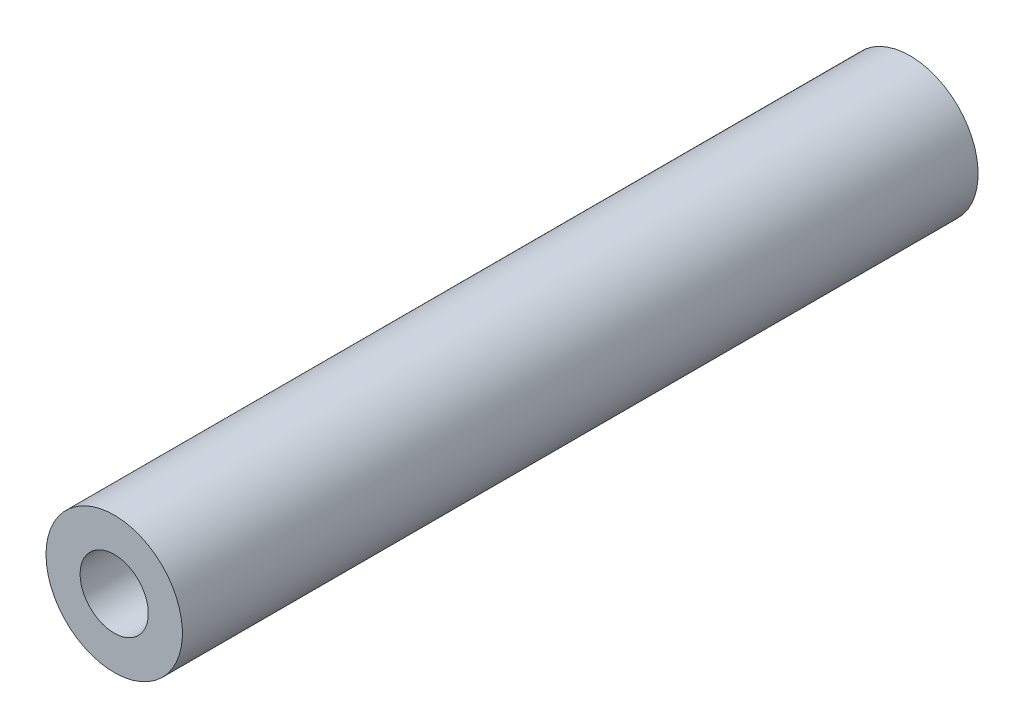
ISO-10303-21;
HEADER;
FILE_DESCRIPTION(('STEP AP214'),'2;1');
FILE_NAME('part.step','',(''),(''),'','','');
FILE_SCHEMA(('AUTOMOTIVE_DESIGN { 1 0 10303 214 1 1 1 1 }'));
ENDSEC;
DATA;
#1=APPLICATION_CONTEXT('core data for automotive mechanical design processes');
#2=APPLICATION_PROTOCOL_DEFINITION('international standard','automotive_design',2000,#1);
#3=PRODUCT_CONTEXT('',#1,'mechanical');
#4=PRODUCT('Part','Part','',(#3));
#5=PRODUCT_RELATED_PRODUCT_CATEGORY('part','',(#4));
#6=PRODUCT_DEFINITION_FORMATION('','',#4);
#7=PRODUCT_DEFINITION_CONTEXT('part definition',#1,'design');
#8=PRODUCT_DEFINITION('design','',#6,#7);
#9=PRODUCT_DEFINITION_SHAPE('','',#8);
#10=(LENGTH_UNIT() NAMED_UNIT(*) SI_UNIT(.MILLI.,.METRE.));
#11=(NAMED_UNIT(*) PLANE_ANGLE_UNIT() SI_UNIT($,.RADIAN.));
#12=(NAMED_UNIT(*) SI_UNIT($,.STERADIAN.) SOLID_ANGLE_UNIT());
#13=UNCERTAINTY_MEASURE_WITH_UNIT(LENGTH_MEASURE(1.E-05),#10,'distance_accuracy_value','');
#14=(GEOMETRIC_REPRESENTATION_CONTEXT(3) GLOBAL_UNCERTAINTY_ASSIGNED_CONTEXT((#13)) GLOBAL_UNIT_ASSIGNED_CONTEXT((#10,
#11,#12)) REPRESENTATION_CONTEXT('',''));
#15=CARTESIAN_POINT('',(0.,0.,0.));
#16=DIRECTION('',(0.,0.,1.));
#17=DIRECTION('',(1.,0.,0.));
#18=AXIS2_PLACEMENT_3D('',#15,#16,#17);
#19=CARTESIAN_POINT('',(0.,0.,0.));
#20=DIRECTION('',(0.,0.,1.));
#21=DIRECTION('',(1.,0.,0.));
#22=AXIS2_PLACEMENT_3D('',#19,#20,#21);
#23=PLANE('',#22);
#24=CARTESIAN_POINT('',(0.,0.,0.));
#25=DIRECTION('',(0.,0.,-1.));
#26=DIRECTION('',(1.,0.,0.));
#27=AXIS2_PLACEMENT_3D('',#24,#25,#26);
#28=CIRCLE('',#27,1.5);
#29=CARTESIAN_POINT('',(-1.5,0.,0.));
#30=VERTEX_POINT('',#29);
#31=EDGE_CURVE('E48',#30,#30,#28,.T.);
#32=ORIENTED_EDGE('',*,*,#31,.F.);
#33=EDGE_LOOP('',(#32));
#34=FACE_BOUND('',#33,.T.);
#35=CARTESIAN_POINT('',(0.,0.,0.));
#36=DIRECTION('',(0.,0.,1.));
#37=DIRECTION('',(1.,0.,0.));
#38=AXIS2_PLACEMENT_3D('',#35,#36,#37);
#39=CIRCLE('',#38,3.);
#40=CARTESIAN_POINT('',(-3.,0.,0.));
#41=VERTEX_POINT('',#40);
#42=EDGE_CURVE('E11',#41,#41,#39,.T.);
#43=ORIENTED_EDGE('',*,*,#42,.F.);
#44=EDGE_LOOP('',(#43));
#45=FACE_BOUND('',#44,.T.);
#46=ADVANCED_FACE('F17',(#34,#45),#23,.F.);
#47=CARTESIAN_POINT('',(0.,0.,0.));
#48=DIRECTION('',(0.,0.,1.));
#49=DIRECTION('',(1.,0.,0.));
#50=AXIS2_PLACEMENT_3D('',#47,#48,#49);
#51=CYLINDRICAL_SURFACE('',#50,3.);
#52=CARTESIAN_POINT('',(0.,0.,35.));
#53=DIRECTION('',(0.,0.,1.));
#54=DIRECTION('',(1.,0.,0.));
#55=AXIS2_PLACEMENT_3D('',#52,#53,#54);
#56=CIRCLE('',#55,3.);
#57=CARTESIAN_POINT('',(-3.,0.,35.));
#58=VERTEX_POINT('',#57);
#59=EDGE_CURVE('E55',#58,#58,#56,.T.);
#60=ORIENTED_EDGE('',*,*,#59,.F.);
#61=DIRECTION('',(0.,0.,-1.));
#62=VECTOR('',#61,1.);
#63=CARTESIAN_POINT('',(-3.,0.,0.));
#64=LINE('',#63,#62);
#65=EDGE_CURVE('E26',#58,#41,#64,.T.);
#66=ORIENTED_EDGE('',*,*,#65,.T.);
#67=ORIENTED_EDGE('',*,*,#42,.T.);
#68=ORIENTED_EDGE('',*,*,#65,.F.);
#69=EDGE_LOOP('',(#60,#66,#67,#68));
#70=FACE_BOUND('',#69,.T.);
#71=ADVANCED_FACE('F54',(#70),#51,.T.);
#72=CARTESIAN_POINT('',(0.,0.,0.));
#73=DIRECTION('',(0.,0.,1.));
#74=DIRECTION('',(1.,0.,0.));
#75=AXIS2_PLACEMENT_3D('',#72,#73,#74);
#76=CYLINDRICAL_SURFACE('',#75,1.5);
#77=CARTESIAN_POINT('',(0.,0.,35.));
#78=DIRECTION('',(0.,0.,-1.));
#79=DIRECTION('',(1.,0.,0.));
#80=AXIS2_PLACEMENT_3D('',#77,#78,#79);
#81=CIRCLE('',#80,1.5);
#82=CARTESIAN_POINT('',(-1.5,0.,35.));
#83=VERTEX_POINT('',#82);
#84=EDGE_CURVE('E20',#83,#83,#81,.T.);
#85=ORIENTED_EDGE('',*,*,#84,.F.);
#86=DIRECTION('',(0.,0.,-1.));
#87=VECTOR('',#86,1.);
#88=CARTESIAN_POINT('',(-1.5,0.,0.));
#89=LINE('',#88,#87);
#90=EDGE_CURVE('E66',#83,#30,#89,.T.);
#91=ORIENTED_EDGE('',*,*,#90,.T.);
#92=ORIENTED_EDGE('',*,*,#31,.T.);
#93=ORIENTED_EDGE('',*,*,#90,.F.);
#94=EDGE_LOOP('',(#85,#91,#92,#93));
#95=FACE_BOUND('',#94,.T.);
#96=ADVANCED_FACE('F74',(#95),#76,.F.);
#97=CARTESIAN_POINT('',(0.,0.,35.));
#98=DIRECTION('',(0.,0.,1.));
#99=DIRECTION('',(1.,0.,0.));
#100=AXIS2_PLACEMENT_3D('',#97,#98,#99);
#101=PLANE('',#100);
#102=ORIENTED_EDGE('',*,*,#84,.T.);
#103=EDGE_LOOP('',(#102));
#104=FACE_BOUND('',#103,.T.);
#105=ORIENTED_EDGE('',*,*,#59,.T.);
#106=EDGE_LOOP('',(#105));
#107=FACE_BOUND('',#106,.T.);
#108=ADVANCED_FACE('F59',(#104,#107),#101,.T.);
#109=CLOSED_SHELL('',(#46,#71,#96,#108));
#110=MANIFOLD_SOLID_BREP('B1',#109);
#111=ADVANCED_BREP_SHAPE_REPRESENTATION('',(#18,#110),#14);
#112=SHAPE_DEFINITION_REPRESENTATION(#9,#111);
ENDSEC;
END-ISO-10303-21;
